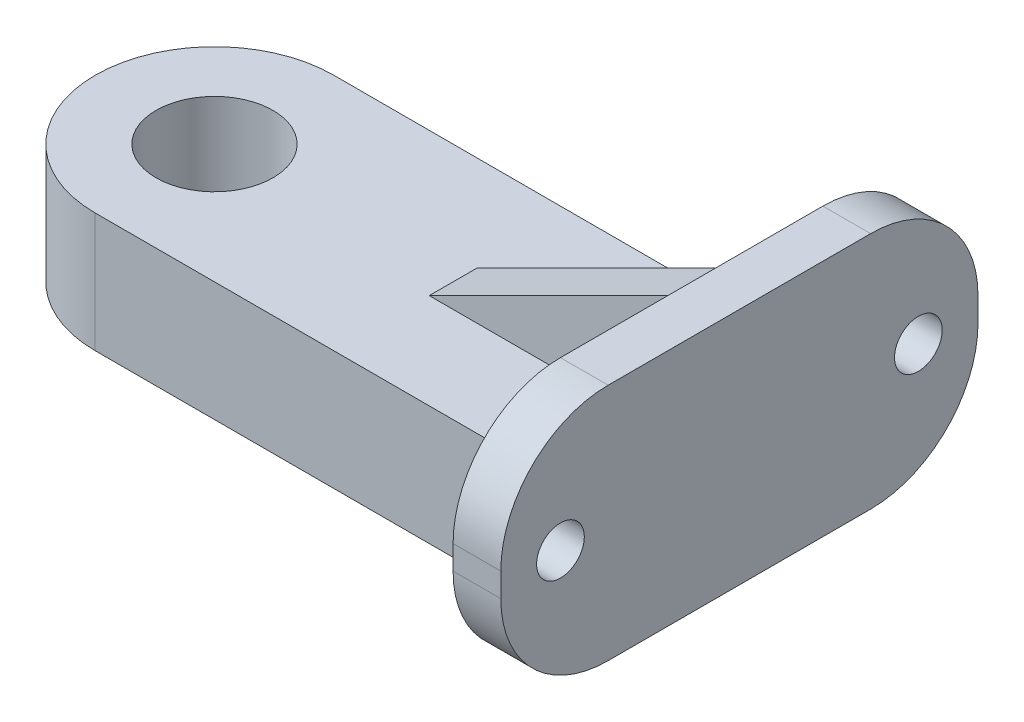
ISO-10303-21;
HEADER;
FILE_DESCRIPTION(('STEP AP214'),'2;1');
FILE_NAME('part.step','',(''),(''),'','','');
FILE_SCHEMA(('AUTOMOTIVE_DESIGN { 1 0 10303 214 1 1 1 1 }'));
ENDSEC;
DATA;
#1=APPLICATION_CONTEXT('core data for automotive mechanical design processes');
#2=APPLICATION_PROTOCOL_DEFINITION('international standard','automotive_design',2000,#1);
#3=PRODUCT_CONTEXT('',#1,'mechanical');
#4=PRODUCT('Part','Part','',(#3));
#5=PRODUCT_RELATED_PRODUCT_CATEGORY('part','',(#4));
#6=PRODUCT_DEFINITION_FORMATION('','',#4);
#7=PRODUCT_DEFINITION_CONTEXT('part definition',#1,'design');
#8=PRODUCT_DEFINITION('design','',#6,#7);
#9=PRODUCT_DEFINITION_SHAPE('','',#8);
#10=(LENGTH_UNIT() NAMED_UNIT(*) SI_UNIT(.MILLI.,.METRE.));
#11=(NAMED_UNIT(*) PLANE_ANGLE_UNIT() SI_UNIT($,.RADIAN.));
#12=(NAMED_UNIT(*) SI_UNIT($,.STERADIAN.) SOLID_ANGLE_UNIT());
#13=UNCERTAINTY_MEASURE_WITH_UNIT(LENGTH_MEASURE(1.E-05),#10,'distance_accuracy_value','');
#14=(GEOMETRIC_REPRESENTATION_CONTEXT(3) GLOBAL_UNCERTAINTY_ASSIGNED_CONTEXT((#13)) GLOBAL_UNIT_ASSIGNED_CONTEXT((#10,
#11,#12)) REPRESENTATION_CONTEXT('',''));
#15=CARTESIAN_POINT('',(0.,0.,0.));
#16=DIRECTION('',(0.,0.,1.));
#17=DIRECTION('',(1.,0.,0.));
#18=AXIS2_PLACEMENT_3D('',#15,#16,#17);
#19=CARTESIAN_POINT('',(20.,4.5,-5.5));
#20=DIRECTION('',(1.,0.,0.));
#21=DIRECTION('',(0.,0.,-1.));
#22=AXIS2_PLACEMENT_3D('',#19,#20,#21);
#23=PLANE('',#22);
#24=CARTESIAN_POINT('',(20.,5.,-7.5));
#25=DIRECTION('',(1.,0.,0.));
#26=DIRECTION('',(0.,0.,-1.));
#27=AXIS2_PLACEMENT_3D('',#24,#25,#26);
#28=CIRCLE('',#27,1.);
#29=CARTESIAN_POINT('',(20.,5.,-8.5));
#30=VERTEX_POINT('',#29);
#31=EDGE_CURVE('E576',#30,#30,#28,.T.);
#32=ORIENTED_EDGE('',*,*,#31,.T.);
#33=EDGE_LOOP('',(#32));
#34=FACE_BOUND('',#33,.T.);
#35=DIRECTION('',(0.,1.,0.));
#36=VECTOR('',#35,1.);
#37=CARTESIAN_POINT('',(20.,10.,-1.));
#38=LINE('',#37,#36);
#39=CARTESIAN_POINT('',(20.,5.,-1.));
#40=VERTEX_POINT('',#39);
#41=CARTESIAN_POINT('',(20.,10.,-1.));
#42=VERTEX_POINT('',#41);
#43=EDGE_CURVE('E601',#40,#42,#38,.T.);
#44=ORIENTED_EDGE('',*,*,#43,.T.);
#45=DIRECTION('',(0.,0.,1.));
#46=VECTOR('',#45,1.);
#47=CARTESIAN_POINT('',(20.,10.,5.49999999999997));
#48=LINE('',#47,#46);
#49=CARTESIAN_POINT('',(20.,10.,-5.49999999999997));
#50=VERTEX_POINT('',#49);
#51=EDGE_CURVE('E532',#50,#42,#48,.T.);
#52=ORIENTED_EDGE('',*,*,#51,.F.);
#53=CARTESIAN_POINT('',(20.,5.5,-5.5));
#54=DIRECTION('',(1.,0.,0.));
#55=DIRECTION('',(0.,0.,1.));
#56=AXIS2_PLACEMENT_3D('',#53,#54,#55);
#57=CIRCLE('',#56,4.5);
#58=CARTESIAN_POINT('',(20.,5.49999999999997,-10.));
#59=VERTEX_POINT('',#58);
#60=EDGE_CURVE('E524',#59,#50,#57,.T.);
#61=ORIENTED_EDGE('',*,*,#60,.F.);
#62=DIRECTION('',(0.,1.,0.));
#63=VECTOR('',#62,1.);
#64=CARTESIAN_POINT('',(20.,5.49999999999997,-10.));
#65=LINE('',#64,#63);
#66=CARTESIAN_POINT('',(20.,4.50000000000003,-10.));
#67=VERTEX_POINT('',#66);
#68=EDGE_CURVE('E517',#67,#59,#65,.T.);
#69=ORIENTED_EDGE('',*,*,#68,.F.);
#70=CARTESIAN_POINT('',(20.,4.5,-5.5));
#71=DIRECTION('',(1.,0.,0.));
#72=DIRECTION('',(0.,0.,-1.));
#73=AXIS2_PLACEMENT_3D('',#70,#71,#72);
#74=CIRCLE('',#73,4.5);
#75=CARTESIAN_POINT('',(20.,0.,-5.49999999999997));
#76=VERTEX_POINT('',#75);
#77=EDGE_CURVE('E525',#76,#67,#74,.T.);
#78=ORIENTED_EDGE('',*,*,#77,.F.);
#79=DIRECTION('',(0.,0.,-1.));
#80=VECTOR('',#79,1.);
#81=CARTESIAN_POINT('',(20.,0.,5.49999999999997));
#82=LINE('',#81,#80);
#83=CARTESIAN_POINT('',(20.,0.,-5.));
#84=VERTEX_POINT('',#83);
#85=EDGE_CURVE('E221',#84,#76,#82,.T.);
#86=ORIENTED_EDGE('',*,*,#85,.F.);
#87=DIRECTION('',(0.,-1.,0.));
#88=VECTOR('',#87,1.);
#89=CARTESIAN_POINT('',(20.,5.,-5.));
#90=LINE('',#89,#88);
#91=CARTESIAN_POINT('',(20.,5.,-5.));
#92=VERTEX_POINT('',#91);
#93=EDGE_CURVE('E204',#92,#84,#90,.T.);
#94=ORIENTED_EDGE('',*,*,#93,.F.);
#95=DIRECTION('',(0.,0.,-1.));
#96=VECTOR('',#95,1.);
#97=CARTESIAN_POINT('',(20.,5.,-5.));
#98=LINE('',#97,#96);
#99=EDGE_CURVE('E182',#40,#92,#98,.T.);
#100=ORIENTED_EDGE('',*,*,#99,.F.);
#101=EDGE_LOOP('',(#44,#52,#61,#69,#78,#86,#94,#100));
#102=FACE_BOUND('',#101,.T.);
#103=ADVANCED_FACE('F43',(#34,#102),#23,.F.);
#104=CARTESIAN_POINT('',(0.,5.,0.));
#105=DIRECTION('',(0.,1.,0.));
#106=DIRECTION('',(0.,0.,1.));
#107=AXIS2_PLACEMENT_3D('',#104,#105,#106);
#108=PLANE('',#107);
#109=DIRECTION('',(1.,0.,0.));
#110=VECTOR('',#109,1.);
#111=CARTESIAN_POINT('',(20.,5.,1.));
#112=LINE('',#111,#110);
#113=CARTESIAN_POINT('',(10.,5.,1.));
#114=VERTEX_POINT('',#113);
#115=CARTESIAN_POINT('',(20.,5.,1.));
#116=VERTEX_POINT('',#115);
#117=EDGE_CURVE('E158',#114,#116,#112,.T.);
#118=ORIENTED_EDGE('',*,*,#117,.F.);
#119=DIRECTION('',(0.,0.,-1.));
#120=VECTOR('',#119,1.);
#121=CARTESIAN_POINT('',(10.,5.,1.));
#122=LINE('',#121,#120);
#123=CARTESIAN_POINT('',(10.,5.,-1.));
#124=VERTEX_POINT('',#123);
#125=EDGE_CURVE('E588',#114,#124,#122,.T.);
#126=ORIENTED_EDGE('',*,*,#125,.T.);
#127=DIRECTION('',(1.,0.,0.));
#128=VECTOR('',#127,1.);
#129=CARTESIAN_POINT('',(20.,5.,-1.));
#130=LINE('',#129,#128);
#131=EDGE_CURVE('E604',#124,#40,#130,.T.);
#132=ORIENTED_EDGE('',*,*,#131,.T.);
#133=ORIENTED_EDGE('',*,*,#99,.T.);
#134=DIRECTION('',(-1.,0.,0.));
#135=VECTOR('',#134,1.);
#136=CARTESIAN_POINT('',(0.,5.,-5.));
#137=LINE('',#136,#135);
#138=CARTESIAN_POINT('',(0.,5.,-5.));
#139=VERTEX_POINT('',#138);
#140=EDGE_CURVE('E68',#92,#139,#137,.T.);
#141=ORIENTED_EDGE('',*,*,#140,.T.);
#142=CARTESIAN_POINT('',(0.,5.,0.));
#143=DIRECTION('',(0.,1.,0.));
#144=DIRECTION('',(0.,0.,1.));
#145=AXIS2_PLACEMENT_3D('',#142,#143,#144);
#146=CIRCLE('',#145,5.);
#147=CARTESIAN_POINT('',(0.,5.,5.));
#148=VERTEX_POINT('',#147);
#149=EDGE_CURVE('E201',#139,#148,#146,.T.);
#150=ORIENTED_EDGE('',*,*,#149,.T.);
#151=DIRECTION('',(1.,0.,0.));
#152=VECTOR('',#151,1.);
#153=CARTESIAN_POINT('',(0.,5.,5.));
#154=LINE('',#153,#152);
#155=CARTESIAN_POINT('',(20.,5.,5.));
#156=VERTEX_POINT('',#155);
#157=EDGE_CURVE('E92',#148,#156,#154,.T.);
#158=ORIENTED_EDGE('',*,*,#157,.T.);
#159=EDGE_CURVE('E173',#156,#116,#98,.T.);
#160=ORIENTED_EDGE('',*,*,#159,.T.);
#161=EDGE_LOOP('',(#118,#126,#132,#133,#141,#150,#158,#160));
#162=FACE_BOUND('',#161,.T.);
#163=CARTESIAN_POINT('',(0.,5.,0.));
#164=DIRECTION('',(0.,1.,0.));
#165=DIRECTION('',(0.,0.,1.));
#166=AXIS2_PLACEMENT_3D('',#163,#164,#165);
#167=CIRCLE('',#166,2.45);
#168=CARTESIAN_POINT('',(0.,5.,2.45));
#169=VERTEX_POINT('',#168);
#170=EDGE_CURVE('E196',#169,#169,#167,.T.);
#171=ORIENTED_EDGE('',*,*,#170,.F.);
#172=EDGE_LOOP('',(#171));
#173=FACE_BOUND('',#172,.T.);
#174=ADVANCED_FACE('F179',(#162,#173),#108,.T.);
#175=CARTESIAN_POINT('',(0.,0.,0.));
#176=DIRECTION('',(0.,1.,0.));
#177=DIRECTION('',(0.,0.,1.));
#178=AXIS2_PLACEMENT_3D('',#175,#176,#177);
#179=PLANE('',#178);
#180=CARTESIAN_POINT('',(0.,0.,0.));
#181=DIRECTION('',(0.,1.,0.));
#182=DIRECTION('',(0.,0.,1.));
#183=AXIS2_PLACEMENT_3D('',#180,#181,#182);
#184=CIRCLE('',#183,5.);
#185=CARTESIAN_POINT('',(0.,0.,-5.));
#186=VERTEX_POINT('',#185);
#187=CARTESIAN_POINT('',(0.,0.,5.));
#188=VERTEX_POINT('',#187);
#189=EDGE_CURVE('E191',#186,#188,#184,.T.);
#190=ORIENTED_EDGE('',*,*,#189,.F.);
#191=DIRECTION('',(-1.,0.,0.));
#192=VECTOR('',#191,1.);
#193=CARTESIAN_POINT('',(0.,0.,-5.));
#194=LINE('',#193,#192);
#195=EDGE_CURVE('E85',#84,#186,#194,.T.);
#196=ORIENTED_EDGE('',*,*,#195,.F.);
#197=ORIENTED_EDGE('',*,*,#85,.T.);
#198=DIRECTION('',(-1.,0.,0.));
#199=VECTOR('',#198,1.);
#200=CARTESIAN_POINT('',(22.,0.,-5.49999999999997));
#201=LINE('',#200,#199);
#202=CARTESIAN_POINT('',(22.,0.,-5.49999999999997));
#203=VERTEX_POINT('',#202);
#204=EDGE_CURVE('E232',#203,#76,#201,.T.);
#205=ORIENTED_EDGE('',*,*,#204,.F.);
#206=DIRECTION('',(0.,0.,-1.));
#207=VECTOR('',#206,1.);
#208=CARTESIAN_POINT('',(22.,0.,5.49999999999997));
#209=LINE('',#208,#207);
#210=CARTESIAN_POINT('',(22.,0.,5.49999999999997));
#211=VERTEX_POINT('',#210);
#212=EDGE_CURVE('E236',#211,#203,#209,.T.);
#213=ORIENTED_EDGE('',*,*,#212,.F.);
#214=DIRECTION('',(-1.,0.,0.));
#215=VECTOR('',#214,1.);
#216=CARTESIAN_POINT('',(22.,0.,5.49999999999997));
#217=LINE('',#216,#215);
#218=CARTESIAN_POINT('',(20.,0.,5.49999999999997));
#219=VERTEX_POINT('',#218);
#220=EDGE_CURVE('E218',#211,#219,#217,.T.);
#221=ORIENTED_EDGE('',*,*,#220,.T.);
#222=CARTESIAN_POINT('',(20.,0.,5.));
#223=VERTEX_POINT('',#222);
#224=EDGE_CURVE('E210',#219,#223,#82,.T.);
#225=ORIENTED_EDGE('',*,*,#224,.T.);
#226=DIRECTION('',(1.,0.,0.));
#227=VECTOR('',#226,1.);
#228=CARTESIAN_POINT('',(0.,0.,5.));
#229=LINE('',#228,#227);
#230=EDGE_CURVE('E195',#188,#223,#229,.T.);
#231=ORIENTED_EDGE('',*,*,#230,.F.);
#232=EDGE_LOOP('',(#190,#196,#197,#205,#213,#221,#225,#231));
#233=FACE_BOUND('',#232,.T.);
#234=CARTESIAN_POINT('',(0.,0.,0.));
#235=DIRECTION('',(0.,1.,0.));
#236=DIRECTION('',(0.,0.,1.));
#237=AXIS2_PLACEMENT_3D('',#234,#235,#236);
#238=CIRCLE('',#237,2.45);
#239=CARTESIAN_POINT('',(0.,0.,2.45));
#240=VERTEX_POINT('',#239);
#241=EDGE_CURVE('E263',#240,#240,#238,.T.);
#242=ORIENTED_EDGE('',*,*,#241,.T.);
#243=EDGE_LOOP('',(#242));
#244=FACE_BOUND('',#243,.T.);
#245=ADVANCED_FACE('F214',(#233,#244),#179,.F.);
#246=CARTESIAN_POINT('',(0.,5.,0.));
#247=DIRECTION('',(0.,-1.,0.));
#248=DIRECTION('',(0.,0.,-1.));
#249=AXIS2_PLACEMENT_3D('',#246,#247,#248);
#250=CYLINDRICAL_SURFACE('',#249,5.);
#251=ORIENTED_EDGE('',*,*,#189,.T.);
#252=DIRECTION('',(0.,-1.,0.));
#253=VECTOR('',#252,1.);
#254=CARTESIAN_POINT('',(0.,5.,5.));
#255=LINE('',#254,#253);
#256=EDGE_CURVE('E11',#148,#188,#255,.T.);
#257=ORIENTED_EDGE('',*,*,#256,.F.);
#258=ORIENTED_EDGE('',*,*,#149,.F.);
#259=DIRECTION('',(0.,-1.,0.));
#260=VECTOR('',#259,1.);
#261=CARTESIAN_POINT('',(0.,5.,-5.));
#262=LINE('',#261,#260);
#263=EDGE_CURVE('E186',#139,#186,#262,.T.);
#264=ORIENTED_EDGE('',*,*,#263,.T.);
#265=EDGE_LOOP('',(#251,#257,#258,#264));
#266=FACE_BOUND('',#265,.T.);
#267=ADVANCED_FACE('F45',(#266),#250,.T.);
#268=CARTESIAN_POINT('',(0.,5.,5.));
#269=DIRECTION('',(0.,0.,-1.));
#270=DIRECTION('',(-1.,0.,0.));
#271=AXIS2_PLACEMENT_3D('',#268,#269,#270);
#272=PLANE('',#271);
#273=ORIENTED_EDGE('',*,*,#230,.T.);
#274=DIRECTION('',(0.,-1.,0.));
#275=VECTOR('',#274,1.);
#276=CARTESIAN_POINT('',(20.,5.,5.));
#277=LINE('',#276,#275);
#278=EDGE_CURVE('E52',#156,#223,#277,.T.);
#279=ORIENTED_EDGE('',*,*,#278,.F.);
#280=ORIENTED_EDGE('',*,*,#157,.F.);
#281=ORIENTED_EDGE('',*,*,#256,.T.);
#282=EDGE_LOOP('',(#273,#279,#280,#281));
#283=FACE_BOUND('',#282,.T.);
#284=ADVANCED_FACE('F274',(#283),#272,.F.);
#285=CARTESIAN_POINT('',(0.,5.,-5.));
#286=DIRECTION('',(0.,0.,1.));
#287=DIRECTION('',(1.,0.,0.));
#288=AXIS2_PLACEMENT_3D('',#285,#286,#287);
#289=PLANE('',#288);
#290=ORIENTED_EDGE('',*,*,#195,.T.);
#291=ORIENTED_EDGE('',*,*,#263,.F.);
#292=ORIENTED_EDGE('',*,*,#140,.F.);
#293=ORIENTED_EDGE('',*,*,#93,.T.);
#294=EDGE_LOOP('',(#290,#291,#292,#293));
#295=FACE_BOUND('',#294,.T.);
#296=ADVANCED_FACE('F276',(#295),#289,.F.);
#297=CARTESIAN_POINT('',(0.,5.,0.));
#298=DIRECTION('',(0.,-1.,0.));
#299=DIRECTION('',(0.,0.,-1.));
#300=AXIS2_PLACEMENT_3D('',#297,#298,#299);
#301=CYLINDRICAL_SURFACE('',#300,2.45);
#302=ORIENTED_EDGE('',*,*,#170,.T.);
#303=EDGE_LOOP('',(#302));
#304=FACE_BOUND('',#303,.T.);
#305=ORIENTED_EDGE('',*,*,#241,.F.);
#306=EDGE_LOOP('',(#305));
#307=FACE_BOUND('',#306,.T.);
#308=ADVANCED_FACE('F281',(#304,#307),#301,.F.);
#309=CARTESIAN_POINT('',(22.,4.5,-5.5));
#310=DIRECTION('',(1.,0.,0.));
#311=DIRECTION('',(0.,0.,-1.));
#312=AXIS2_PLACEMENT_3D('',#309,#310,#311);
#313=PLANE('',#312);
#314=CARTESIAN_POINT('',(22.,5.,7.5));
#315=DIRECTION('',(1.,0.,0.));
#316=DIRECTION('',(0.,0.,-1.));
#317=AXIS2_PLACEMENT_3D('',#314,#315,#316);
#318=CIRCLE('',#317,1.);
#319=CARTESIAN_POINT('',(22.,5.,6.5));
#320=VERTEX_POINT('',#319);
#321=EDGE_CURVE('E566',#320,#320,#318,.T.);
#322=ORIENTED_EDGE('',*,*,#321,.F.);
#323=EDGE_LOOP('',(#322));
#324=FACE_BOUND('',#323,.T.);
#325=CARTESIAN_POINT('',(22.,4.5,-5.5));
#326=DIRECTION('',(1.,0.,0.));
#327=DIRECTION('',(0.,0.,-1.));
#328=AXIS2_PLACEMENT_3D('',#325,#326,#327);
#329=CIRCLE('',#328,4.5);
#330=CARTESIAN_POINT('',(22.,4.50000000000003,-10.));
#331=VERTEX_POINT('',#330);
#332=EDGE_CURVE('E220',#203,#331,#329,.T.);
#333=ORIENTED_EDGE('',*,*,#332,.T.);
#334=DIRECTION('',(0.,1.,0.));
#335=VECTOR('',#334,1.);
#336=CARTESIAN_POINT('',(22.,5.49999999999997,-10.));
#337=LINE('',#336,#335);
#338=CARTESIAN_POINT('',(22.,5.49999999999997,-10.));
#339=VERTEX_POINT('',#338);
#340=EDGE_CURVE('E226',#331,#339,#337,.T.);
#341=ORIENTED_EDGE('',*,*,#340,.T.);
#342=CARTESIAN_POINT('',(22.,5.5,-5.5));
#343=DIRECTION('',(1.,0.,0.));
#344=DIRECTION('',(0.,0.,1.));
#345=AXIS2_PLACEMENT_3D('',#342,#343,#344);
#346=CIRCLE('',#345,4.5);
#347=CARTESIAN_POINT('',(22.,10.,-5.49999999999997));
#348=VERTEX_POINT('',#347);
#349=EDGE_CURVE('E528',#339,#348,#346,.T.);
#350=ORIENTED_EDGE('',*,*,#349,.T.);
#351=DIRECTION('',(0.,0.,1.));
#352=VECTOR('',#351,1.);
#353=CARTESIAN_POINT('',(22.,10.,5.49999999999997));
#354=LINE('',#353,#352);
#355=CARTESIAN_POINT('',(22.,10.,5.49999999999997));
#356=VERTEX_POINT('',#355);
#357=EDGE_CURVE('E560',#348,#356,#354,.T.);
#358=ORIENTED_EDGE('',*,*,#357,.T.);
#359=CARTESIAN_POINT('',(22.,5.5,5.5));
#360=DIRECTION('',(1.,0.,0.));
#361=DIRECTION('',(0.,0.,-1.));
#362=AXIS2_PLACEMENT_3D('',#359,#360,#361);
#363=CIRCLE('',#362,4.5);
#364=CARTESIAN_POINT('',(22.,5.49999999999997,10.));
#365=VERTEX_POINT('',#364);
#366=EDGE_CURVE('E555',#356,#365,#363,.T.);
#367=ORIENTED_EDGE('',*,*,#366,.T.);
#368=DIRECTION('',(0.,-1.,0.));
#369=VECTOR('',#368,1.);
#370=CARTESIAN_POINT('',(22.,5.49999999999997,10.));
#371=LINE('',#370,#369);
#372=CARTESIAN_POINT('',(22.,4.50000000000003,10.));
#373=VERTEX_POINT('',#372);
#374=EDGE_CURVE('E552',#365,#373,#371,.T.);
#375=ORIENTED_EDGE('',*,*,#374,.T.);
#376=CARTESIAN_POINT('',(22.,4.5,5.5));
#377=DIRECTION('',(1.,0.,0.));
#378=DIRECTION('',(0.,0.,-1.));
#379=AXIS2_PLACEMENT_3D('',#376,#377,#378);
#380=CIRCLE('',#379,4.5);
#381=EDGE_CURVE('E554',#373,#211,#380,.T.);
#382=ORIENTED_EDGE('',*,*,#381,.T.);
#383=ORIENTED_EDGE('',*,*,#212,.T.);
#384=EDGE_LOOP('',(#333,#341,#350,#358,#367,#375,#382,#383));
#385=FACE_BOUND('',#384,.T.);
#386=CARTESIAN_POINT('',(22.,5.,-7.5));
#387=DIRECTION('',(1.,0.,0.));
#388=DIRECTION('',(0.,0.,-1.));
#389=AXIS2_PLACEMENT_3D('',#386,#387,#388);
#390=CIRCLE('',#389,1.);
#391=CARTESIAN_POINT('',(22.,5.,-8.5));
#392=VERTEX_POINT('',#391);
#393=EDGE_CURVE('E573',#392,#392,#390,.T.);
#394=ORIENTED_EDGE('',*,*,#393,.F.);
#395=EDGE_LOOP('',(#394));
#396=FACE_BOUND('',#395,.T.);
#397=ADVANCED_FACE('F296',(#324,#385,#396),#313,.T.);
#398=CARTESIAN_POINT('',(20.,10.,1.));
#399=VERTEX_POINT('',#398);
#400=CARTESIAN_POINT('',(20.,10.,5.49999999999997));
#401=VERTEX_POINT('',#400);
#402=EDGE_CURVE('E175',#399,#401,#48,.T.);
#403=ORIENTED_EDGE('',*,*,#402,.F.);
#404=DIRECTION('',(0.,1.,0.));
#405=VECTOR('',#404,1.);
#406=CARTESIAN_POINT('',(20.,10.,1.));
#407=LINE('',#406,#405);
#408=EDGE_CURVE('E161',#116,#399,#407,.T.);
#409=ORIENTED_EDGE('',*,*,#408,.F.);
#410=ORIENTED_EDGE('',*,*,#159,.F.);
#411=ORIENTED_EDGE('',*,*,#278,.T.);
#412=ORIENTED_EDGE('',*,*,#224,.F.);
#413=CARTESIAN_POINT('',(20.,4.5,5.5));
#414=DIRECTION('',(1.,0.,0.));
#415=DIRECTION('',(0.,0.,-1.));
#416=AXIS2_PLACEMENT_3D('',#413,#414,#415);
#417=CIRCLE('',#416,4.5);
#418=CARTESIAN_POINT('',(20.,4.50000000000003,10.));
#419=VERTEX_POINT('',#418);
#420=EDGE_CURVE('E228',#419,#219,#417,.T.);
#421=ORIENTED_EDGE('',*,*,#420,.F.);
#422=DIRECTION('',(0.,-1.,0.));
#423=VECTOR('',#422,1.);
#424=CARTESIAN_POINT('',(20.,5.49999999999997,10.));
#425=LINE('',#424,#423);
#426=CARTESIAN_POINT('',(20.,5.49999999999997,10.));
#427=VERTEX_POINT('',#426);
#428=EDGE_CURVE('E542',#427,#419,#425,.T.);
#429=ORIENTED_EDGE('',*,*,#428,.F.);
#430=CARTESIAN_POINT('',(20.,5.5,5.5));
#431=DIRECTION('',(1.,0.,0.));
#432=DIRECTION('',(0.,0.,-1.));
#433=AXIS2_PLACEMENT_3D('',#430,#431,#432);
#434=CIRCLE('',#433,4.5);
#435=EDGE_CURVE('E540',#401,#427,#434,.T.);
#436=ORIENTED_EDGE('',*,*,#435,.F.);
#437=EDGE_LOOP('',(#403,#409,#410,#411,#412,#421,#429,#436));
#438=FACE_BOUND('',#437,.T.);
#439=CARTESIAN_POINT('',(20.,5.,7.5));
#440=DIRECTION('',(1.,0.,0.));
#441=DIRECTION('',(0.,0.,-1.));
#442=AXIS2_PLACEMENT_3D('',#439,#440,#441);
#443=CIRCLE('',#442,1.);
#444=CARTESIAN_POINT('',(20.,5.,6.5));
#445=VERTEX_POINT('',#444);
#446=EDGE_CURVE('E569',#445,#445,#443,.T.);
#447=ORIENTED_EDGE('',*,*,#446,.T.);
#448=EDGE_LOOP('',(#447));
#449=FACE_BOUND('',#448,.T.);
#450=ADVANCED_FACE('F170',(#438,#449),#23,.F.);
#451=CARTESIAN_POINT('',(22.,4.5,-5.5));
#452=DIRECTION('',(-1.,0.,0.));
#453=DIRECTION('',(0.,0.,1.));
#454=AXIS2_PLACEMENT_3D('',#451,#452,#453);
#455=CYLINDRICAL_SURFACE('',#454,4.5);
#456=ORIENTED_EDGE('',*,*,#77,.T.);
#457=DIRECTION('',(-1.,0.,0.));
#458=VECTOR('',#457,1.);
#459=CARTESIAN_POINT('',(22.,4.50000000000003,-10.));
#460=LINE('',#459,#458);
#461=EDGE_CURVE('E259',#331,#67,#460,.T.);
#462=ORIENTED_EDGE('',*,*,#461,.F.);
#463=ORIENTED_EDGE('',*,*,#332,.F.);
#464=ORIENTED_EDGE('',*,*,#204,.T.);
#465=EDGE_LOOP('',(#456,#462,#463,#464));
#466=FACE_BOUND('',#465,.T.);
#467=ADVANCED_FACE('F295',(#466),#455,.T.);
#468=CARTESIAN_POINT('',(22.,5.49999999999997,-10.));
#469=DIRECTION('',(0.,0.,1.));
#470=DIRECTION('',(1.,0.,0.));
#471=AXIS2_PLACEMENT_3D('',#468,#469,#470);
#472=PLANE('',#471);
#473=ORIENTED_EDGE('',*,*,#68,.T.);
#474=DIRECTION('',(-1.,0.,0.));
#475=VECTOR('',#474,1.);
#476=CARTESIAN_POINT('',(22.,5.49999999999997,-10.));
#477=LINE('',#476,#475);
#478=EDGE_CURVE('E255',#339,#59,#477,.T.);
#479=ORIENTED_EDGE('',*,*,#478,.F.);
#480=ORIENTED_EDGE('',*,*,#340,.F.);
#481=ORIENTED_EDGE('',*,*,#461,.T.);
#482=EDGE_LOOP('',(#473,#479,#480,#481));
#483=FACE_BOUND('',#482,.T.);
#484=ADVANCED_FACE('F301',(#483),#472,.F.);
#485=CARTESIAN_POINT('',(22.,5.5,-5.5));
#486=DIRECTION('',(-1.,0.,0.));
#487=DIRECTION('',(0.,0.,1.));
#488=AXIS2_PLACEMENT_3D('',#485,#486,#487);
#489=CYLINDRICAL_SURFACE('',#488,4.5);
#490=ORIENTED_EDGE('',*,*,#60,.T.);
#491=DIRECTION('',(-1.,0.,0.));
#492=VECTOR('',#491,1.);
#493=CARTESIAN_POINT('',(22.,10.,-5.49999999999997));
#494=LINE('',#493,#492);
#495=EDGE_CURVE('E251',#348,#50,#494,.T.);
#496=ORIENTED_EDGE('',*,*,#495,.F.);
#497=ORIENTED_EDGE('',*,*,#349,.F.);
#498=ORIENTED_EDGE('',*,*,#478,.T.);
#499=EDGE_LOOP('',(#490,#496,#497,#498));
#500=FACE_BOUND('',#499,.T.);
#501=ADVANCED_FACE('F413',(#500),#489,.T.);
#502=CARTESIAN_POINT('',(22.,10.,5.49999999999997));
#503=DIRECTION('',(0.,-1.,0.));
#504=DIRECTION('',(0.,0.,-1.));
#505=AXIS2_PLACEMENT_3D('',#502,#503,#504);
#506=PLANE('',#505);
#507=ORIENTED_EDGE('',*,*,#51,.T.);
#508=DIRECTION('',(0.,0.,-1.));
#509=VECTOR('',#508,1.);
#510=CARTESIAN_POINT('',(20.,10.,1.));
#511=LINE('',#510,#509);
#512=EDGE_CURVE('E585',#399,#42,#511,.T.);
#513=ORIENTED_EDGE('',*,*,#512,.F.);
#514=ORIENTED_EDGE('',*,*,#402,.T.);
#515=DIRECTION('',(-1.,0.,0.));
#516=VECTOR('',#515,1.);
#517=CARTESIAN_POINT('',(22.,10.,5.49999999999997));
#518=LINE('',#517,#516);
#519=EDGE_CURVE('E247',#356,#401,#518,.T.);
#520=ORIENTED_EDGE('',*,*,#519,.F.);
#521=ORIENTED_EDGE('',*,*,#357,.F.);
#522=ORIENTED_EDGE('',*,*,#495,.T.);
#523=EDGE_LOOP('',(#507,#513,#514,#520,#521,#522));
#524=FACE_BOUND('',#523,.T.);
#525=ADVANCED_FACE('F402',(#524),#506,.F.);
#526=CARTESIAN_POINT('',(22.,5.5,5.5));
#527=DIRECTION('',(-1.,0.,0.));
#528=DIRECTION('',(0.,0.,1.));
#529=AXIS2_PLACEMENT_3D('',#526,#527,#528);
#530=CYLINDRICAL_SURFACE('',#529,4.5);
#531=ORIENTED_EDGE('',*,*,#435,.T.);
#532=DIRECTION('',(-1.,0.,0.));
#533=VECTOR('',#532,1.);
#534=CARTESIAN_POINT('',(22.,5.49999999999997,10.));
#535=LINE('',#534,#533);
#536=EDGE_CURVE('E243',#365,#427,#535,.T.);
#537=ORIENTED_EDGE('',*,*,#536,.F.);
#538=ORIENTED_EDGE('',*,*,#366,.F.);
#539=ORIENTED_EDGE('',*,*,#519,.T.);
#540=EDGE_LOOP('',(#531,#537,#538,#539));
#541=FACE_BOUND('',#540,.T.);
#542=ADVANCED_FACE('F391',(#541),#530,.T.);
#543=CARTESIAN_POINT('',(22.,5.49999999999997,10.));
#544=DIRECTION('',(0.,0.,-1.));
#545=DIRECTION('',(-1.,0.,0.));
#546=AXIS2_PLACEMENT_3D('',#543,#544,#545);
#547=PLANE('',#546);
#548=ORIENTED_EDGE('',*,*,#428,.T.);
#549=DIRECTION('',(-1.,0.,0.));
#550=VECTOR('',#549,1.);
#551=CARTESIAN_POINT('',(22.,4.50000000000003,10.));
#552=LINE('',#551,#550);
#553=EDGE_CURVE('E239',#373,#419,#552,.T.);
#554=ORIENTED_EDGE('',*,*,#553,.F.);
#555=ORIENTED_EDGE('',*,*,#374,.F.);
#556=ORIENTED_EDGE('',*,*,#536,.T.);
#557=EDGE_LOOP('',(#548,#554,#555,#556));
#558=FACE_BOUND('',#557,.T.);
#559=ADVANCED_FACE('F381',(#558),#547,.F.);
#560=CARTESIAN_POINT('',(22.,4.5,5.5));
#561=DIRECTION('',(-1.,0.,0.));
#562=DIRECTION('',(0.,0.,1.));
#563=AXIS2_PLACEMENT_3D('',#560,#561,#562);
#564=CYLINDRICAL_SURFACE('',#563,4.5);
#565=ORIENTED_EDGE('',*,*,#420,.T.);
#566=ORIENTED_EDGE('',*,*,#220,.F.);
#567=ORIENTED_EDGE('',*,*,#381,.F.);
#568=ORIENTED_EDGE('',*,*,#553,.T.);
#569=EDGE_LOOP('',(#565,#566,#567,#568));
#570=FACE_BOUND('',#569,.T.);
#571=ADVANCED_FACE('F317',(#570),#564,.T.);
#572=CARTESIAN_POINT('',(22.,5.,7.5));
#573=DIRECTION('',(-1.,0.,0.));
#574=DIRECTION('',(0.,0.,1.));
#575=AXIS2_PLACEMENT_3D('',#572,#573,#574);
#576=CYLINDRICAL_SURFACE('',#575,1.);
#577=ORIENTED_EDGE('',*,*,#321,.T.);
#578=EDGE_LOOP('',(#577));
#579=FACE_BOUND('',#578,.T.);
#580=ORIENTED_EDGE('',*,*,#446,.F.);
#581=EDGE_LOOP('',(#580));
#582=FACE_BOUND('',#581,.T.);
#583=ADVANCED_FACE('F313',(#579,#582),#576,.F.);
#584=CARTESIAN_POINT('',(22.,5.,-7.5));
#585=DIRECTION('',(-1.,0.,0.));
#586=DIRECTION('',(0.,0.,1.));
#587=AXIS2_PLACEMENT_3D('',#584,#585,#586);
#588=CYLINDRICAL_SURFACE('',#587,1.);
#589=ORIENTED_EDGE('',*,*,#393,.T.);
#590=EDGE_LOOP('',(#589));
#591=FACE_BOUND('',#590,.T.);
#592=ORIENTED_EDGE('',*,*,#31,.F.);
#593=EDGE_LOOP('',(#592));
#594=FACE_BOUND('',#593,.T.);
#595=ADVANCED_FACE('F316',(#591,#594),#588,.F.);
#596=CARTESIAN_POINT('',(10.,5.,1.));
#597=DIRECTION('',(0.447213595499958,-0.894427190999916,0.));
#598=DIRECTION('',(0.894427190999916,0.447213595499958,0.));
#599=AXIS2_PLACEMENT_3D('',#596,#597,#598);
#600=PLANE('',#599);
#601=DIRECTION('',(-0.894427190999916,-0.447213595499958,0.));
#602=VECTOR('',#601,1.);
#603=CARTESIAN_POINT('',(10.,5.,-1.));
#604=LINE('',#603,#602);
#605=EDGE_CURVE('E166',#42,#124,#604,.T.);
#606=ORIENTED_EDGE('',*,*,#605,.T.);
#607=ORIENTED_EDGE('',*,*,#125,.F.);
#608=DIRECTION('',(-0.894427190999916,-0.447213595499958,0.));
#609=VECTOR('',#608,1.);
#610=CARTESIAN_POINT('',(10.,5.,1.));
#611=LINE('',#610,#609);
#612=EDGE_CURVE('E59',#399,#114,#611,.T.);
#613=ORIENTED_EDGE('',*,*,#612,.F.);
#614=ORIENTED_EDGE('',*,*,#512,.T.);
#615=EDGE_LOOP('',(#606,#607,#613,#614));
#616=FACE_BOUND('',#615,.T.);
#617=ADVANCED_FACE('F321',(#616),#600,.F.);
#618=CARTESIAN_POINT('',(0.,0.,1.));
#619=DIRECTION('',(0.,0.,1.));
#620=DIRECTION('',(1.,0.,0.));
#621=AXIS2_PLACEMENT_3D('',#618,#619,#620);
#622=PLANE('',#621);
#623=ORIENTED_EDGE('',*,*,#117,.T.);
#624=ORIENTED_EDGE('',*,*,#408,.T.);
#625=ORIENTED_EDGE('',*,*,#612,.T.);
#626=EDGE_LOOP('',(#623,#624,#625));
#627=FACE_BOUND('',#626,.T.);
#628=ADVANCED_FACE('F160',(#627),#622,.T.);
#629=CARTESIAN_POINT('',(0.,0.,-1.));
#630=DIRECTION('',(0.,0.,1.));
#631=DIRECTION('',(1.,0.,0.));
#632=AXIS2_PLACEMENT_3D('',#629,#630,#631);
#633=PLANE('',#632);
#634=ORIENTED_EDGE('',*,*,#131,.F.);
#635=ORIENTED_EDGE('',*,*,#605,.F.);
#636=ORIENTED_EDGE('',*,*,#43,.F.);
#637=EDGE_LOOP('',(#634,#635,#636));
#638=FACE_BOUND('',#637,.T.);
#639=ADVANCED_FACE('F325',(#638),#633,.F.);
#640=CLOSED_SHELL('',(#103,#174,#245,#267,#284,#296,#308,#397,#450,#467,#484,#501,#525,#542,
#559,#571,#583,#595,#617,#628,#639));
#641=MANIFOLD_SOLID_BREP('B2',#640);
#642=ADVANCED_BREP_SHAPE_REPRESENTATION('',(#18,#641),#14);
#643=SHAPE_DEFINITION_REPRESENTATION(#9,#642);
ENDSEC;
END-ISO-10303-21;
